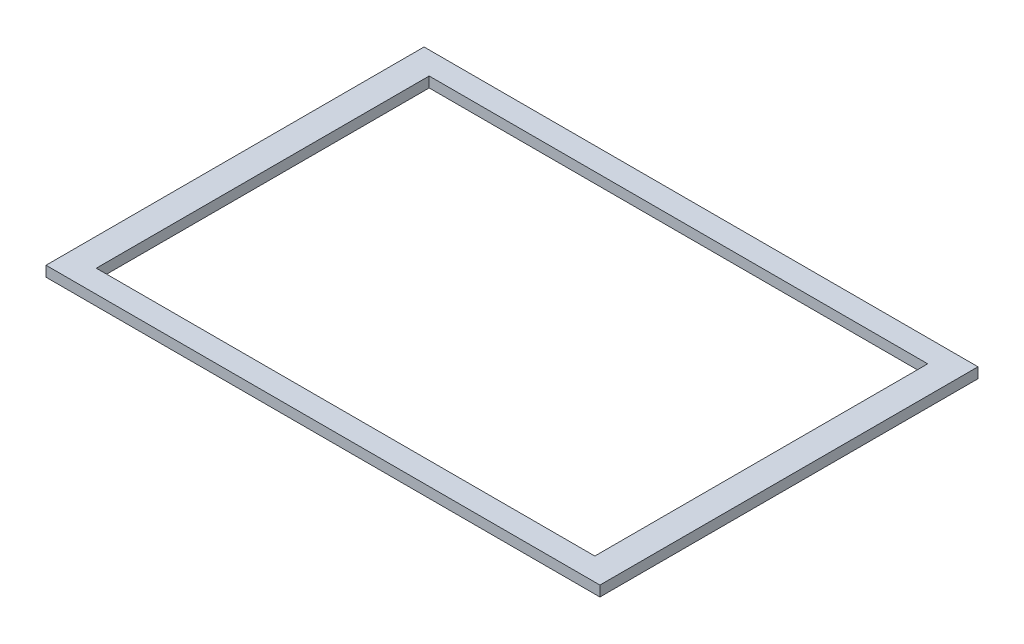
ISO-10303-21;
HEADER;
FILE_DESCRIPTION(('STEP AP214'),'2;1');
FILE_NAME('part.step','',(''),(''),'','','');
FILE_SCHEMA(('AUTOMOTIVE_DESIGN { 1 0 10303 214 1 1 1 1 }'));
ENDSEC;
DATA;
#1=APPLICATION_CONTEXT('core data for automotive mechanical design processes');
#2=APPLICATION_PROTOCOL_DEFINITION('international standard','automotive_design',2000,#1);
#3=PRODUCT_CONTEXT('',#1,'mechanical');
#4=PRODUCT('Part','Part','',(#3));
#5=PRODUCT_RELATED_PRODUCT_CATEGORY('part','',(#4));
#6=PRODUCT_DEFINITION_FORMATION('','',#4);
#7=PRODUCT_DEFINITION_CONTEXT('part definition',#1,'design');
#8=PRODUCT_DEFINITION('design','',#6,#7);
#9=PRODUCT_DEFINITION_SHAPE('','',#8);
#10=(LENGTH_UNIT() NAMED_UNIT(*) SI_UNIT(.MILLI.,.METRE.));
#11=(NAMED_UNIT(*) PLANE_ANGLE_UNIT() SI_UNIT($,.RADIAN.));
#12=(NAMED_UNIT(*) SI_UNIT($,.STERADIAN.) SOLID_ANGLE_UNIT());
#13=UNCERTAINTY_MEASURE_WITH_UNIT(LENGTH_MEASURE(1.E-05),#10,'distance_accuracy_value','');
#14=(GEOMETRIC_REPRESENTATION_CONTEXT(3) GLOBAL_UNCERTAINTY_ASSIGNED_CONTEXT((#13)) GLOBAL_UNIT_ASSIGNED_CONTEXT((#10,
#11,#12)) REPRESENTATION_CONTEXT('',''));
#15=CARTESIAN_POINT('',(0.,0.,0.));
#16=DIRECTION('',(0.,0.,1.));
#17=DIRECTION('',(1.,0.,0.));
#18=AXIS2_PLACEMENT_3D('',#15,#16,#17);
#19=CARTESIAN_POINT('',(-127.,4.7625,86.6775));
#20=DIRECTION('',(0.,-1.,0.));
#21=DIRECTION('',(0.,0.,-1.));
#22=AXIS2_PLACEMENT_3D('',#19,#20,#21);
#23=PLANE('',#22);
#24=DIRECTION('',(0.,0.,1.));
#25=VECTOR('',#24,1.);
#26=CARTESIAN_POINT('',(-127.,4.7625,-86.6775));
#27=LINE('',#26,#25);
#28=CARTESIAN_POINT('',(-127.,4.7625,-86.6775));
#29=VERTEX_POINT('',#28);
#30=CARTESIAN_POINT('',(-127.,4.7625,86.6775));
#31=VERTEX_POINT('',#30);
#32=EDGE_CURVE('E134',#29,#31,#27,.T.);
#33=ORIENTED_EDGE('',*,*,#32,.T.);
#34=DIRECTION('',(1.,0.,0.));
#35=VECTOR('',#34,1.);
#36=CARTESIAN_POINT('',(127.,4.7625,86.6775));
#37=LINE('',#36,#35);
#38=CARTESIAN_POINT('',(127.,4.7625,86.6775));
#39=VERTEX_POINT('',#38);
#40=EDGE_CURVE('E137',#31,#39,#37,.T.);
#41=ORIENTED_EDGE('',*,*,#40,.T.);
#42=DIRECTION('',(0.,0.,-1.));
#43=VECTOR('',#42,1.);
#44=CARTESIAN_POINT('',(127.,4.7625,-86.6775));
#45=LINE('',#44,#43);
#46=CARTESIAN_POINT('',(127.,4.7625,-86.6775));
#47=VERTEX_POINT('',#46);
#48=EDGE_CURVE('E140',#39,#47,#45,.T.);
#49=ORIENTED_EDGE('',*,*,#48,.T.);
#50=DIRECTION('',(-1.,0.,0.));
#51=VECTOR('',#50,1.);
#52=CARTESIAN_POINT('',(127.,4.7625,-86.6775));
#53=LINE('',#52,#51);
#54=EDGE_CURVE('E142',#47,#29,#53,.T.);
#55=ORIENTED_EDGE('',*,*,#54,.T.);
#56=EDGE_LOOP('',(#33,#41,#49,#55));
#57=FACE_BOUND('',#56,.T.);
#58=DIRECTION('',(0.,0.,1.));
#59=VECTOR('',#58,1.);
#60=CARTESIAN_POINT('',(-114.3,4.7625,-76.327));
#61=LINE('',#60,#59);
#62=CARTESIAN_POINT('',(-114.3,4.7625,-76.327));
#63=VERTEX_POINT('',#62);
#64=CARTESIAN_POINT('',(-114.3,4.7625,76.3269999999999));
#65=VERTEX_POINT('',#64);
#66=EDGE_CURVE('E98',#63,#65,#61,.T.);
#67=ORIENTED_EDGE('',*,*,#66,.F.);
#68=DIRECTION('',(-1.,0.,0.));
#69=VECTOR('',#68,1.);
#70=CARTESIAN_POINT('',(114.3,4.7625,-76.3270000000001));
#71=LINE('',#70,#69);
#72=CARTESIAN_POINT('',(114.3,4.7625,-76.3270000000001));
#73=VERTEX_POINT('',#72);
#74=EDGE_CURVE('E120',#73,#63,#71,.T.);
#75=ORIENTED_EDGE('',*,*,#74,.F.);
#76=DIRECTION('',(0.,0.,-1.));
#77=VECTOR('',#76,1.);
#78=CARTESIAN_POINT('',(114.3,4.7625,-76.3270000000001));
#79=LINE('',#78,#77);
#80=CARTESIAN_POINT('',(114.3,4.7625,76.3269999999999));
#81=VERTEX_POINT('',#80);
#82=EDGE_CURVE('E118',#81,#73,#79,.T.);
#83=ORIENTED_EDGE('',*,*,#82,.F.);
#84=DIRECTION('',(1.,0.,0.));
#85=VECTOR('',#84,1.);
#86=CARTESIAN_POINT('',(114.3,4.7625,76.3269999999999));
#87=LINE('',#86,#85);
#88=EDGE_CURVE('E106',#65,#81,#87,.T.);
#89=ORIENTED_EDGE('',*,*,#88,.F.);
#90=EDGE_LOOP('',(#67,#75,#83,#89));
#91=FACE_BOUND('',#90,.T.);
#92=ADVANCED_FACE('F33',(#57,#91),#23,.F.);
#93=CARTESIAN_POINT('',(-127.,0.,86.6775));
#94=DIRECTION('',(0.,-1.,0.));
#95=DIRECTION('',(0.,0.,-1.));
#96=AXIS2_PLACEMENT_3D('',#93,#94,#95);
#97=PLANE('',#96);
#98=DIRECTION('',(0.,0.,1.));
#99=VECTOR('',#98,1.);
#100=CARTESIAN_POINT('',(-127.,0.,-86.6775));
#101=LINE('',#100,#99);
#102=CARTESIAN_POINT('',(-127.,0.,-86.6775));
#103=VERTEX_POINT('',#102);
#104=CARTESIAN_POINT('',(-127.,0.,86.6775));
#105=VERTEX_POINT('',#104);
#106=EDGE_CURVE('E114',#103,#105,#101,.T.);
#107=ORIENTED_EDGE('',*,*,#106,.F.);
#108=DIRECTION('',(-1.,0.,0.));
#109=VECTOR('',#108,1.);
#110=CARTESIAN_POINT('',(127.,0.,-86.6775));
#111=LINE('',#110,#109);
#112=CARTESIAN_POINT('',(127.,0.,-86.6775));
#113=VERTEX_POINT('',#112);
#114=EDGE_CURVE('E138',#113,#103,#111,.T.);
#115=ORIENTED_EDGE('',*,*,#114,.F.);
#116=DIRECTION('',(0.,0.,-1.));
#117=VECTOR('',#116,1.);
#118=CARTESIAN_POINT('',(127.,0.,-86.6775));
#119=LINE('',#118,#117);
#120=CARTESIAN_POINT('',(127.,0.,86.6775));
#121=VERTEX_POINT('',#120);
#122=EDGE_CURVE('E149',#121,#113,#119,.T.);
#123=ORIENTED_EDGE('',*,*,#122,.F.);
#124=DIRECTION('',(1.,0.,0.));
#125=VECTOR('',#124,1.);
#126=CARTESIAN_POINT('',(127.,0.,86.6775));
#127=LINE('',#126,#125);
#128=EDGE_CURVE('E147',#105,#121,#127,.T.);
#129=ORIENTED_EDGE('',*,*,#128,.F.);
#130=EDGE_LOOP('',(#107,#115,#123,#129));
#131=FACE_BOUND('',#130,.T.);
#132=DIRECTION('',(-1.,0.,0.));
#133=VECTOR('',#132,1.);
#134=CARTESIAN_POINT('',(114.3,0.,-76.3270000000001));
#135=LINE('',#134,#133);
#136=CARTESIAN_POINT('',(114.3,0.,-76.3270000000001));
#137=VERTEX_POINT('',#136);
#138=CARTESIAN_POINT('',(-114.3,0.,-76.327));
#139=VERTEX_POINT('',#138);
#140=EDGE_CURVE('E107',#137,#139,#135,.T.);
#141=ORIENTED_EDGE('',*,*,#140,.T.);
#142=DIRECTION('',(0.,0.,1.));
#143=VECTOR('',#142,1.);
#144=CARTESIAN_POINT('',(-114.3,0.,-76.327));
#145=LINE('',#144,#143);
#146=CARTESIAN_POINT('',(-114.3,0.,76.3269999999999));
#147=VERTEX_POINT('',#146);
#148=EDGE_CURVE('E56',#139,#147,#145,.T.);
#149=ORIENTED_EDGE('',*,*,#148,.T.);
#150=DIRECTION('',(1.,0.,0.));
#151=VECTOR('',#150,1.);
#152=CARTESIAN_POINT('',(114.3,0.,76.3269999999999));
#153=LINE('',#152,#151);
#154=CARTESIAN_POINT('',(114.3,0.,76.3269999999999));
#155=VERTEX_POINT('',#154);
#156=EDGE_CURVE('E113',#147,#155,#153,.T.);
#157=ORIENTED_EDGE('',*,*,#156,.T.);
#158=DIRECTION('',(0.,0.,-1.));
#159=VECTOR('',#158,1.);
#160=CARTESIAN_POINT('',(114.3,0.,-76.3270000000001));
#161=LINE('',#160,#159);
#162=EDGE_CURVE('E126',#155,#137,#161,.T.);
#163=ORIENTED_EDGE('',*,*,#162,.T.);
#164=EDGE_LOOP('',(#141,#149,#157,#163));
#165=FACE_BOUND('',#164,.T.);
#166=ADVANCED_FACE('F167',(#131,#165),#97,.T.);
#167=CARTESIAN_POINT('',(-127.,4.7625,-86.6775));
#168=DIRECTION('',(1.,0.,0.));
#169=DIRECTION('',(0.,0.,-1.));
#170=AXIS2_PLACEMENT_3D('',#167,#168,#169);
#171=PLANE('',#170);
#172=ORIENTED_EDGE('',*,*,#106,.T.);
#173=DIRECTION('',(0.,-1.,0.));
#174=VECTOR('',#173,1.);
#175=CARTESIAN_POINT('',(-127.,4.7625,86.6775));
#176=LINE('',#175,#174);
#177=EDGE_CURVE('E11',#31,#105,#176,.T.);
#178=ORIENTED_EDGE('',*,*,#177,.F.);
#179=ORIENTED_EDGE('',*,*,#32,.F.);
#180=DIRECTION('',(0.,-1.,0.));
#181=VECTOR('',#180,1.);
#182=CARTESIAN_POINT('',(-127.,4.7625,-86.6775));
#183=LINE('',#182,#181);
#184=EDGE_CURVE('E144',#29,#103,#183,.T.);
#185=ORIENTED_EDGE('',*,*,#184,.T.);
#186=EDGE_LOOP('',(#172,#178,#179,#185));
#187=FACE_BOUND('',#186,.T.);
#188=ADVANCED_FACE('F35',(#187),#171,.F.);
#189=CARTESIAN_POINT('',(127.,4.7625,86.6775));
#190=DIRECTION('',(0.,0.,-1.));
#191=DIRECTION('',(-1.,0.,0.));
#192=AXIS2_PLACEMENT_3D('',#189,#190,#191);
#193=PLANE('',#192);
#194=ORIENTED_EDGE('',*,*,#128,.T.);
#195=DIRECTION('',(0.,-1.,0.));
#196=VECTOR('',#195,1.);
#197=CARTESIAN_POINT('',(127.,4.7625,86.6775));
#198=LINE('',#197,#196);
#199=EDGE_CURVE('E41',#39,#121,#198,.T.);
#200=ORIENTED_EDGE('',*,*,#199,.F.);
#201=ORIENTED_EDGE('',*,*,#40,.F.);
#202=ORIENTED_EDGE('',*,*,#177,.T.);
#203=EDGE_LOOP('',(#194,#200,#201,#202));
#204=FACE_BOUND('',#203,.T.);
#205=ADVANCED_FACE('F177',(#204),#193,.F.);
#206=CARTESIAN_POINT('',(127.,4.7625,-86.6775));
#207=DIRECTION('',(-1.,0.,0.));
#208=DIRECTION('',(0.,0.,1.));
#209=AXIS2_PLACEMENT_3D('',#206,#207,#208);
#210=PLANE('',#209);
#211=ORIENTED_EDGE('',*,*,#122,.T.);
#212=DIRECTION('',(0.,-1.,0.));
#213=VECTOR('',#212,1.);
#214=CARTESIAN_POINT('',(127.,4.7625,-86.6775));
#215=LINE('',#214,#213);
#216=EDGE_CURVE('E154',#47,#113,#215,.T.);
#217=ORIENTED_EDGE('',*,*,#216,.F.);
#218=ORIENTED_EDGE('',*,*,#48,.F.);
#219=ORIENTED_EDGE('',*,*,#199,.T.);
#220=EDGE_LOOP('',(#211,#217,#218,#219));
#221=FACE_BOUND('',#220,.T.);
#222=ADVANCED_FACE('F161',(#221),#210,.F.);
#223=CARTESIAN_POINT('',(127.,4.7625,-86.6775));
#224=DIRECTION('',(0.,0.,1.));
#225=DIRECTION('',(1.,0.,0.));
#226=AXIS2_PLACEMENT_3D('',#223,#224,#225);
#227=PLANE('',#226);
#228=ORIENTED_EDGE('',*,*,#114,.T.);
#229=ORIENTED_EDGE('',*,*,#184,.F.);
#230=ORIENTED_EDGE('',*,*,#54,.F.);
#231=ORIENTED_EDGE('',*,*,#216,.T.);
#232=EDGE_LOOP('',(#228,#229,#230,#231));
#233=FACE_BOUND('',#232,.T.);
#234=ADVANCED_FACE('F171',(#233),#227,.F.);
#235=CARTESIAN_POINT('',(-114.3,4.7625,-76.327));
#236=DIRECTION('',(1.,0.,0.));
#237=DIRECTION('',(0.,0.,-1.));
#238=AXIS2_PLACEMENT_3D('',#235,#236,#237);
#239=PLANE('',#238);
#240=ORIENTED_EDGE('',*,*,#148,.F.);
#241=DIRECTION('',(0.,-1.,0.));
#242=VECTOR('',#241,1.);
#243=CARTESIAN_POINT('',(-114.3,4.7625,-76.327));
#244=LINE('',#243,#242);
#245=EDGE_CURVE('E102',#63,#139,#244,.T.);
#246=ORIENTED_EDGE('',*,*,#245,.F.);
#247=ORIENTED_EDGE('',*,*,#66,.T.);
#248=DIRECTION('',(0.,-1.,0.));
#249=VECTOR('',#248,1.);
#250=CARTESIAN_POINT('',(-114.3,4.7625,76.3269999999999));
#251=LINE('',#250,#249);
#252=EDGE_CURVE('E101',#65,#147,#251,.T.);
#253=ORIENTED_EDGE('',*,*,#252,.T.);
#254=EDGE_LOOP('',(#240,#246,#247,#253));
#255=FACE_BOUND('',#254,.T.);
#256=ADVANCED_FACE('F100',(#255),#239,.T.);
#257=CARTESIAN_POINT('',(114.3,4.7625,76.3269999999999));
#258=DIRECTION('',(0.,0.,-1.));
#259=DIRECTION('',(-1.,0.,0.));
#260=AXIS2_PLACEMENT_3D('',#257,#258,#259);
#261=PLANE('',#260);
#262=ORIENTED_EDGE('',*,*,#156,.F.);
#263=ORIENTED_EDGE('',*,*,#252,.F.);
#264=ORIENTED_EDGE('',*,*,#88,.T.);
#265=DIRECTION('',(0.,-1.,0.));
#266=VECTOR('',#265,1.);
#267=CARTESIAN_POINT('',(114.3,4.7625,76.3269999999999));
#268=LINE('',#267,#266);
#269=EDGE_CURVE('E115',#81,#155,#268,.T.);
#270=ORIENTED_EDGE('',*,*,#269,.T.);
#271=EDGE_LOOP('',(#262,#263,#264,#270));
#272=FACE_BOUND('',#271,.T.);
#273=ADVANCED_FACE('F110',(#272),#261,.T.);
#274=CARTESIAN_POINT('',(114.3,4.7625,-76.3270000000001));
#275=DIRECTION('',(-1.,0.,0.));
#276=DIRECTION('',(0.,0.,1.));
#277=AXIS2_PLACEMENT_3D('',#274,#275,#276);
#278=PLANE('',#277);
#279=ORIENTED_EDGE('',*,*,#162,.F.);
#280=ORIENTED_EDGE('',*,*,#269,.F.);
#281=ORIENTED_EDGE('',*,*,#82,.T.);
#282=DIRECTION('',(0.,-1.,0.));
#283=VECTOR('',#282,1.);
#284=CARTESIAN_POINT('',(114.3,4.7625,-76.3270000000001));
#285=LINE('',#284,#283);
#286=EDGE_CURVE('E48',#73,#137,#285,.T.);
#287=ORIENTED_EDGE('',*,*,#286,.T.);
#288=EDGE_LOOP('',(#279,#280,#281,#287));
#289=FACE_BOUND('',#288,.T.);
#290=ADVANCED_FACE('F200',(#289),#278,.T.);
#291=CARTESIAN_POINT('',(114.3,4.7625,-76.3270000000001));
#292=DIRECTION('',(0.,0.,1.));
#293=DIRECTION('',(1.,0.,0.));
#294=AXIS2_PLACEMENT_3D('',#291,#292,#293);
#295=PLANE('',#294);
#296=ORIENTED_EDGE('',*,*,#140,.F.);
#297=ORIENTED_EDGE('',*,*,#286,.F.);
#298=ORIENTED_EDGE('',*,*,#74,.T.);
#299=ORIENTED_EDGE('',*,*,#245,.T.);
#300=EDGE_LOOP('',(#296,#297,#298,#299));
#301=FACE_BOUND('',#300,.T.);
#302=ADVANCED_FACE('F204',(#301),#295,.T.);
#303=CLOSED_SHELL('',(#92,#166,#188,#205,#222,#234,#256,#273,#290,#302));
#304=MANIFOLD_SOLID_BREP('B2',#303);
#305=ADVANCED_BREP_SHAPE_REPRESENTATION('',(#18,#304),#14);
#306=SHAPE_DEFINITION_REPRESENTATION(#9,#305);
ENDSEC;
END-ISO-10303-21;
